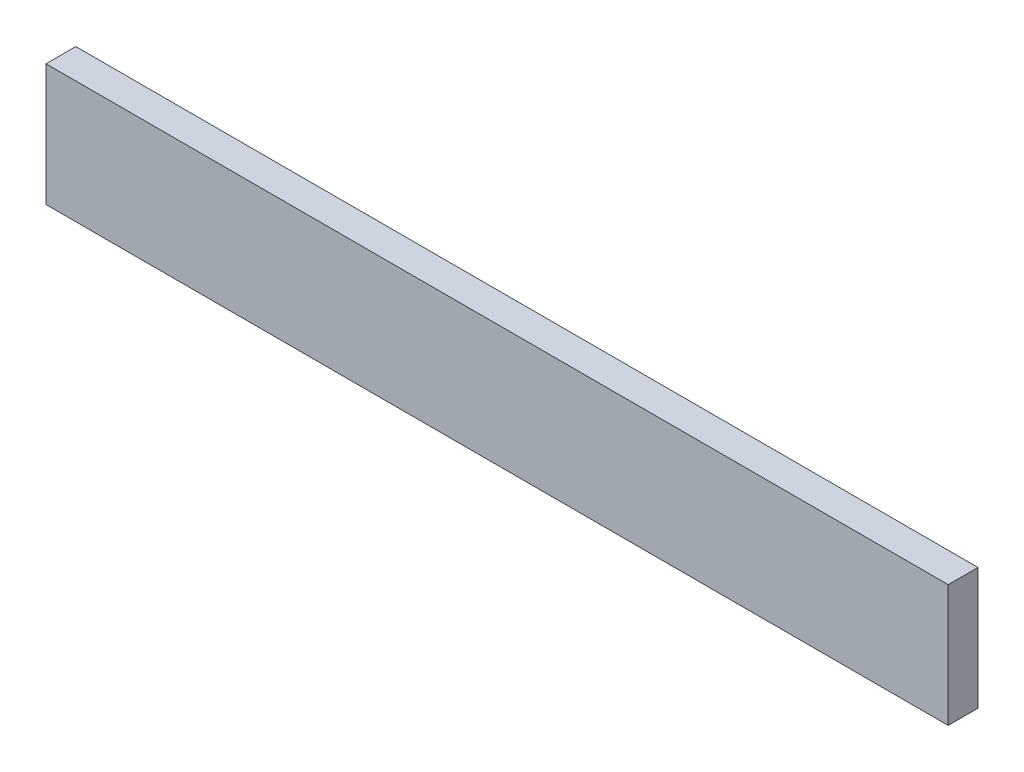
ISO-10303-21;
HEADER;
FILE_DESCRIPTION(('STEP AP214'),'2;1');
FILE_NAME('part.step','',(''),(''),'','','');
FILE_SCHEMA(('AUTOMOTIVE_DESIGN { 1 0 10303 214 1 1 1 1 }'));
ENDSEC;
DATA;
#1=APPLICATION_CONTEXT('core data for automotive mechanical design processes');
#2=APPLICATION_PROTOCOL_DEFINITION('international standard','automotive_design',2000,#1);
#3=PRODUCT_CONTEXT('',#1,'mechanical');
#4=PRODUCT('Part','Part','',(#3));
#5=PRODUCT_RELATED_PRODUCT_CATEGORY('part','',(#4));
#6=PRODUCT_DEFINITION_FORMATION('','',#4);
#7=PRODUCT_DEFINITION_CONTEXT('part definition',#1,'design');
#8=PRODUCT_DEFINITION('design','',#6,#7);
#9=PRODUCT_DEFINITION_SHAPE('','',#8);
#10=(LENGTH_UNIT() NAMED_UNIT(*) SI_UNIT(.MILLI.,.METRE.));
#11=(NAMED_UNIT(*) PLANE_ANGLE_UNIT() SI_UNIT($,.RADIAN.));
#12=(NAMED_UNIT(*) SI_UNIT($,.STERADIAN.) SOLID_ANGLE_UNIT());
#13=UNCERTAINTY_MEASURE_WITH_UNIT(LENGTH_MEASURE(1.E-05),#10,'distance_accuracy_value','');
#14=(GEOMETRIC_REPRESENTATION_CONTEXT(3) GLOBAL_UNCERTAINTY_ASSIGNED_CONTEXT((#13)) GLOBAL_UNIT_ASSIGNED_CONTEXT((#10,
#11,#12)) REPRESENTATION_CONTEXT('',''));
#15=CARTESIAN_POINT('',(0.,0.,0.));
#16=DIRECTION('',(0.,0.,1.));
#17=DIRECTION('',(1.,0.,0.));
#18=AXIS2_PLACEMENT_3D('',#15,#16,#17);
#19=CARTESIAN_POINT('',(0.,0.,22.));
#20=DIRECTION('',(1.,0.,0.));
#21=DIRECTION('',(0.,0.,-1.));
#22=AXIS2_PLACEMENT_3D('',#19,#20,#21);
#23=PLANE('',#22);
#24=DIRECTION('',(0.,-1.,0.));
#25=VECTOR('',#24,1.);
#26=CARTESIAN_POINT('',(0.,0.,0.));
#27=LINE('',#26,#25);
#28=CARTESIAN_POINT('',(0.,90.,0.));
#29=VERTEX_POINT('',#28);
#30=CARTESIAN_POINT('',(0.,0.,0.));
#31=VERTEX_POINT('',#30);
#32=EDGE_CURVE('E94',#29,#31,#27,.T.);
#33=ORIENTED_EDGE('',*,*,#32,.T.);
#34=DIRECTION('',(0.,0.,-1.));
#35=VECTOR('',#34,1.);
#36=CARTESIAN_POINT('',(0.,0.,22.));
#37=LINE('',#36,#35);
#38=CARTESIAN_POINT('',(0.,0.,22.));
#39=VERTEX_POINT('',#38);
#40=EDGE_CURVE('E11',#39,#31,#37,.T.);
#41=ORIENTED_EDGE('',*,*,#40,.F.);
#42=DIRECTION('',(0.,-1.,0.));
#43=VECTOR('',#42,1.);
#44=CARTESIAN_POINT('',(0.,0.,22.));
#45=LINE('',#44,#43);
#46=CARTESIAN_POINT('',(0.,90.,22.));
#47=VERTEX_POINT('',#46);
#48=EDGE_CURVE('E82',#47,#39,#45,.T.);
#49=ORIENTED_EDGE('',*,*,#48,.F.);
#50=DIRECTION('',(0.,0.,-1.));
#51=VECTOR('',#50,1.);
#52=CARTESIAN_POINT('',(0.,90.,22.));
#53=LINE('',#52,#51);
#54=EDGE_CURVE('E90',#47,#29,#53,.T.);
#55=ORIENTED_EDGE('',*,*,#54,.T.);
#56=EDGE_LOOP('',(#33,#41,#49,#55));
#57=FACE_BOUND('',#56,.T.);
#58=ADVANCED_FACE('F31',(#57),#23,.F.);
#59=CARTESIAN_POINT('',(0.,0.,22.));
#60=DIRECTION('',(0.,1.,0.));
#61=DIRECTION('',(0.,0.,1.));
#62=AXIS2_PLACEMENT_3D('',#59,#60,#61);
#63=PLANE('',#62);
#64=DIRECTION('',(1.,0.,0.));
#65=VECTOR('',#64,1.);
#66=CARTESIAN_POINT('',(0.,0.,0.));
#67=LINE('',#66,#65);
#68=CARTESIAN_POINT('',(666.,0.,0.));
#69=VERTEX_POINT('',#68);
#70=EDGE_CURVE('E86',#31,#69,#67,.T.);
#71=ORIENTED_EDGE('',*,*,#70,.T.);
#72=DIRECTION('',(0.,0.,-1.));
#73=VECTOR('',#72,1.);
#74=CARTESIAN_POINT('',(666.,0.,22.));
#75=LINE('',#74,#73);
#76=CARTESIAN_POINT('',(666.,0.,22.));
#77=VERTEX_POINT('',#76);
#78=EDGE_CURVE('E39',#77,#69,#75,.T.);
#79=ORIENTED_EDGE('',*,*,#78,.F.);
#80=DIRECTION('',(1.,0.,0.));
#81=VECTOR('',#80,1.);
#82=CARTESIAN_POINT('',(0.,0.,22.));
#83=LINE('',#82,#81);
#84=EDGE_CURVE('E77',#39,#77,#83,.T.);
#85=ORIENTED_EDGE('',*,*,#84,.F.);
#86=ORIENTED_EDGE('',*,*,#40,.T.);
#87=EDGE_LOOP('',(#71,#79,#85,#86));
#88=FACE_BOUND('',#87,.T.);
#89=ADVANCED_FACE('F85',(#88),#63,.F.);
#90=CARTESIAN_POINT('',(666.,0.,22.));
#91=DIRECTION('',(-1.,0.,0.));
#92=DIRECTION('',(0.,0.,1.));
#93=AXIS2_PLACEMENT_3D('',#90,#91,#92);
#94=PLANE('',#93);
#95=DIRECTION('',(0.,1.,0.));
#96=VECTOR('',#95,1.);
#97=CARTESIAN_POINT('',(666.,0.,0.));
#98=LINE('',#97,#96);
#99=CARTESIAN_POINT('',(666.,90.,0.));
#100=VERTEX_POINT('',#99);
#101=EDGE_CURVE('E64',#69,#100,#98,.T.);
#102=ORIENTED_EDGE('',*,*,#101,.T.);
#103=DIRECTION('',(0.,0.,-1.));
#104=VECTOR('',#103,1.);
#105=CARTESIAN_POINT('',(666.,90.,22.));
#106=LINE('',#105,#104);
#107=CARTESIAN_POINT('',(666.,90.,22.));
#108=VERTEX_POINT('',#107);
#109=EDGE_CURVE('E87',#108,#100,#106,.T.);
#110=ORIENTED_EDGE('',*,*,#109,.F.);
#111=DIRECTION('',(0.,1.,0.));
#112=VECTOR('',#111,1.);
#113=CARTESIAN_POINT('',(666.,0.,22.));
#114=LINE('',#113,#112);
#115=EDGE_CURVE('E80',#77,#108,#114,.T.);
#116=ORIENTED_EDGE('',*,*,#115,.F.);
#117=ORIENTED_EDGE('',*,*,#78,.T.);
#118=EDGE_LOOP('',(#102,#110,#116,#117));
#119=FACE_BOUND('',#118,.T.);
#120=ADVANCED_FACE('F88',(#119),#94,.F.);
#121=CARTESIAN_POINT('',(0.,90.,22.));
#122=DIRECTION('',(0.,-1.,0.));
#123=DIRECTION('',(0.,0.,-1.));
#124=AXIS2_PLACEMENT_3D('',#121,#122,#123);
#125=PLANE('',#124);
#126=DIRECTION('',(-1.,0.,0.));
#127=VECTOR('',#126,1.);
#128=CARTESIAN_POINT('',(0.,90.,0.));
#129=LINE('',#128,#127);
#130=EDGE_CURVE('E70',#100,#29,#129,.T.);
#131=ORIENTED_EDGE('',*,*,#130,.T.);
#132=ORIENTED_EDGE('',*,*,#54,.F.);
#133=DIRECTION('',(-1.,0.,0.));
#134=VECTOR('',#133,1.);
#135=CARTESIAN_POINT('',(0.,90.,22.));
#136=LINE('',#135,#134);
#137=EDGE_CURVE('E47',#108,#47,#136,.T.);
#138=ORIENTED_EDGE('',*,*,#137,.F.);
#139=ORIENTED_EDGE('',*,*,#109,.T.);
#140=EDGE_LOOP('',(#131,#132,#138,#139));
#141=FACE_BOUND('',#140,.T.);
#142=ADVANCED_FACE('F101',(#141),#125,.F.);
#143=CARTESIAN_POINT('',(0.,90.,22.));
#144=DIRECTION('',(0.,0.,-1.));
#145=DIRECTION('',(-1.,0.,0.));
#146=AXIS2_PLACEMENT_3D('',#143,#144,#145);
#147=PLANE('',#146);
#148=ORIENTED_EDGE('',*,*,#48,.T.);
#149=ORIENTED_EDGE('',*,*,#84,.T.);
#150=ORIENTED_EDGE('',*,*,#115,.T.);
#151=ORIENTED_EDGE('',*,*,#137,.T.);
#152=EDGE_LOOP('',(#148,#149,#150,#151));
#153=FACE_BOUND('',#152,.T.);
#154=ADVANCED_FACE('F78',(#153),#147,.F.);
#155=CARTESIAN_POINT('',(0.,90.,0.));
#156=DIRECTION('',(0.,0.,-1.));
#157=DIRECTION('',(-1.,0.,0.));
#158=AXIS2_PLACEMENT_3D('',#155,#156,#157);
#159=PLANE('',#158);
#160=ORIENTED_EDGE('',*,*,#32,.F.);
#161=ORIENTED_EDGE('',*,*,#130,.F.);
#162=ORIENTED_EDGE('',*,*,#101,.F.);
#163=ORIENTED_EDGE('',*,*,#70,.F.);
#164=EDGE_LOOP('',(#160,#161,#162,#163));
#165=FACE_BOUND('',#164,.T.);
#166=ADVANCED_FACE('F104',(#165),#159,.T.);
#167=CLOSED_SHELL('',(#58,#89,#120,#142,#154,#166));
#168=MANIFOLD_SOLID_BREP('B2',#167);
#169=ADVANCED_BREP_SHAPE_REPRESENTATION('',(#18,#168),#14);
#170=SHAPE_DEFINITION_REPRESENTATION(#9,#169);
ENDSEC;
END-ISO-10303-21;
